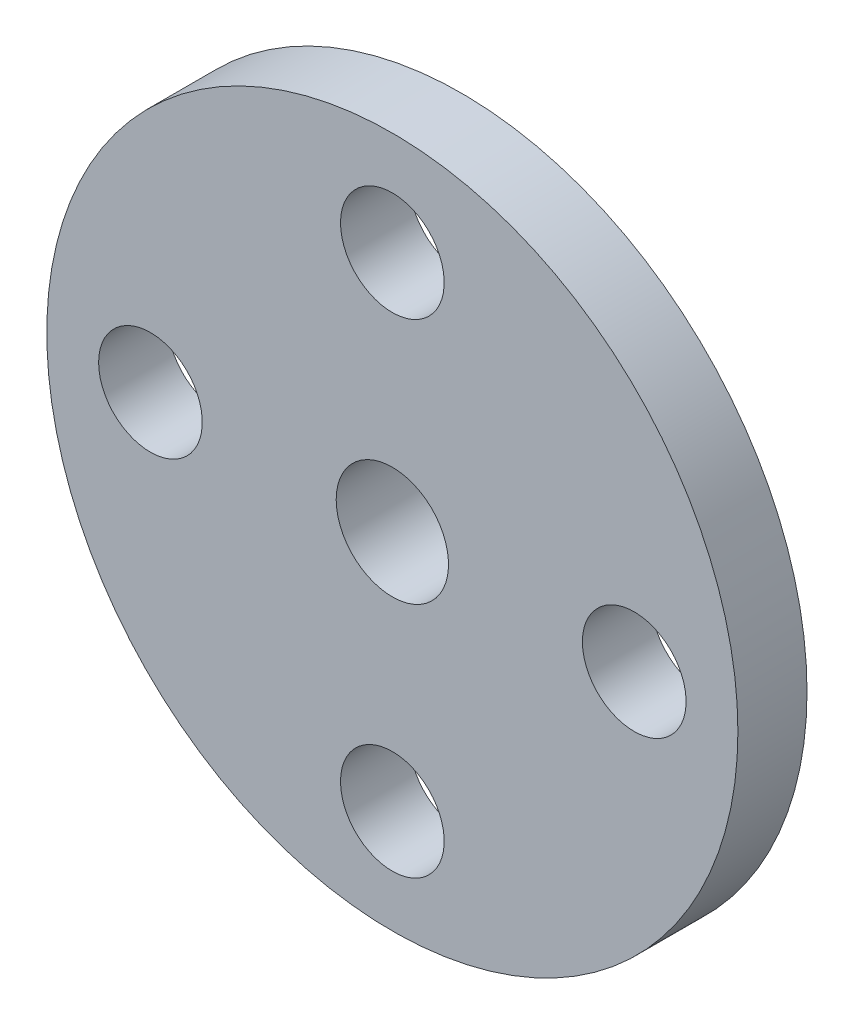
ISO-10303-21;
HEADER;
FILE_DESCRIPTION(('STEP AP214'),'2;1');
FILE_NAME('part.step','',(''),(''),'','','');
FILE_SCHEMA(('AUTOMOTIVE_DESIGN { 1 0 10303 214 1 1 1 1 }'));
ENDSEC;
DATA;
#1=APPLICATION_CONTEXT('core data for automotive mechanical design processes');
#2=APPLICATION_PROTOCOL_DEFINITION('international standard','automotive_design',2000,#1);
#3=PRODUCT_CONTEXT('',#1,'mechanical');
#4=PRODUCT('Part','Part','',(#3));
#5=PRODUCT_RELATED_PRODUCT_CATEGORY('part','',(#4));
#6=PRODUCT_DEFINITION_FORMATION('','',#4);
#7=PRODUCT_DEFINITION_CONTEXT('part definition',#1,'design');
#8=PRODUCT_DEFINITION('design','',#6,#7);
#9=PRODUCT_DEFINITION_SHAPE('','',#8);
#10=(LENGTH_UNIT() NAMED_UNIT(*) SI_UNIT(.MILLI.,.METRE.));
#11=(NAMED_UNIT(*) PLANE_ANGLE_UNIT() SI_UNIT($,.RADIAN.));
#12=(NAMED_UNIT(*) SI_UNIT($,.STERADIAN.) SOLID_ANGLE_UNIT());
#13=UNCERTAINTY_MEASURE_WITH_UNIT(LENGTH_MEASURE(1.E-05),#10,'distance_accuracy_value','');
#14=(GEOMETRIC_REPRESENTATION_CONTEXT(3) GLOBAL_UNCERTAINTY_ASSIGNED_CONTEXT((#13)) GLOBAL_UNIT_ASSIGNED_CONTEXT((#10,
#11,#12)) REPRESENTATION_CONTEXT('',''));
#15=CARTESIAN_POINT('',(0.,0.,0.));
#16=DIRECTION('',(0.,0.,1.));
#17=DIRECTION('',(1.,0.,0.));
#18=AXIS2_PLACEMENT_3D('',#15,#16,#17);
#19=CARTESIAN_POINT('',(0.,0.,2.));
#20=DIRECTION('',(0.,0.,-1.));
#21=DIRECTION('',(-1.,0.,0.));
#22=AXIS2_PLACEMENT_3D('',#19,#20,#21);
#23=CYLINDRICAL_SURFACE('',#22,10.);
#24=CARTESIAN_POINT('',(0.,0.,2.));
#25=DIRECTION('',(0.,0.,1.));
#26=DIRECTION('',(1.,0.,0.));
#27=AXIS2_PLACEMENT_3D('',#24,#25,#26);
#28=CIRCLE('',#27,10.);
#29=CARTESIAN_POINT('',(10.,0.,2.));
#30=VERTEX_POINT('',#29);
#31=EDGE_CURVE('E10',#30,#30,#28,.T.);
#32=ORIENTED_EDGE('',*,*,#31,.F.);
#33=EDGE_LOOP('',(#32));
#34=FACE_BOUND('',#33,.T.);
#35=CARTESIAN_POINT('',(0.,0.,0.));
#36=DIRECTION('',(0.,0.,1.));
#37=DIRECTION('',(1.,0.,0.));
#38=AXIS2_PLACEMENT_3D('',#35,#36,#37);
#39=CIRCLE('',#38,10.);
#40=CARTESIAN_POINT('',(10.,0.,0.));
#41=VERTEX_POINT('',#40);
#42=EDGE_CURVE('E51',#41,#41,#39,.T.);
#43=ORIENTED_EDGE('',*,*,#42,.T.);
#44=EDGE_LOOP('',(#43));
#45=FACE_BOUND('',#44,.T.);
#46=ADVANCED_FACE('F48',(#34,#45),#23,.T.);
#47=CARTESIAN_POINT('',(0.,0.,2.));
#48=DIRECTION('',(0.,0.,1.));
#49=DIRECTION('',(1.,0.,0.));
#50=AXIS2_PLACEMENT_3D('',#47,#48,#49);
#51=PLANE('',#50);
#52=CARTESIAN_POINT('',(0.,0.,2.));
#53=DIRECTION('',(0.,0.,-1.));
#54=DIRECTION('',(-1.,0.,0.));
#55=AXIS2_PLACEMENT_3D('',#52,#53,#54);
#56=CIRCLE('',#55,1.625);
#57=CARTESIAN_POINT('',(-1.625,0.,2.));
#58=VERTEX_POINT('',#57);
#59=EDGE_CURVE('E98',#58,#58,#56,.T.);
#60=ORIENTED_EDGE('',*,*,#59,.T.);
#61=EDGE_LOOP('',(#60));
#62=FACE_BOUND('',#61,.T.);
#63=CARTESIAN_POINT('',(7.,0.,2.));
#64=DIRECTION('',(0.,0.,-1.));
#65=DIRECTION('',(-1.,0.,0.));
#66=AXIS2_PLACEMENT_3D('',#63,#64,#65);
#67=CIRCLE('',#66,1.5);
#68=CARTESIAN_POINT('',(5.5,0.,2.));
#69=VERTEX_POINT('',#68);
#70=EDGE_CURVE('E85',#69,#69,#67,.T.);
#71=ORIENTED_EDGE('',*,*,#70,.T.);
#72=EDGE_LOOP('',(#71));
#73=FACE_BOUND('',#72,.T.);
#74=CARTESIAN_POINT('',(-7.,0.,2.));
#75=DIRECTION('',(0.,0.,-1.));
#76=DIRECTION('',(-1.,0.,0.));
#77=AXIS2_PLACEMENT_3D('',#74,#75,#76);
#78=CIRCLE('',#77,1.5);
#79=CARTESIAN_POINT('',(-8.5,0.,2.));
#80=VERTEX_POINT('',#79);
#81=EDGE_CURVE('E77',#80,#80,#78,.T.);
#82=ORIENTED_EDGE('',*,*,#81,.T.);
#83=EDGE_LOOP('',(#82));
#84=FACE_BOUND('',#83,.T.);
#85=CARTESIAN_POINT('',(0.,-7.,2.));
#86=DIRECTION('',(0.,0.,-1.));
#87=DIRECTION('',(-1.,0.,0.));
#88=AXIS2_PLACEMENT_3D('',#85,#86,#87);
#89=CIRCLE('',#88,1.5);
#90=CARTESIAN_POINT('',(-1.5,-7.,2.));
#91=VERTEX_POINT('',#90);
#92=EDGE_CURVE('E69',#91,#91,#89,.T.);
#93=ORIENTED_EDGE('',*,*,#92,.T.);
#94=EDGE_LOOP('',(#93));
#95=FACE_BOUND('',#94,.T.);
#96=CARTESIAN_POINT('',(0.,7.,2.));
#97=DIRECTION('',(0.,0.,-1.));
#98=DIRECTION('',(-1.,0.,0.));
#99=AXIS2_PLACEMENT_3D('',#96,#97,#98);
#100=CIRCLE('',#99,1.5);
#101=CARTESIAN_POINT('',(-1.5,7.,2.));
#102=VERTEX_POINT('',#101);
#103=EDGE_CURVE('E60',#102,#102,#100,.T.);
#104=ORIENTED_EDGE('',*,*,#103,.T.);
#105=EDGE_LOOP('',(#104));
#106=FACE_BOUND('',#105,.T.);
#107=ORIENTED_EDGE('',*,*,#31,.T.);
#108=EDGE_LOOP('',(#107));
#109=FACE_BOUND('',#108,.T.);
#110=ADVANCED_FACE('F110',(#62,#73,#84,#95,#106,#109),#51,.T.);
#111=CARTESIAN_POINT('',(0.,0.,0.));
#112=DIRECTION('',(0.,0.,1.));
#113=DIRECTION('',(1.,0.,0.));
#114=AXIS2_PLACEMENT_3D('',#111,#112,#113);
#115=PLANE('',#114);
#116=CARTESIAN_POINT('',(0.,0.,0.));
#117=DIRECTION('',(0.,0.,1.));
#118=DIRECTION('',(1.,0.,0.));
#119=AXIS2_PLACEMENT_3D('',#116,#117,#118);
#120=CIRCLE('',#119,4.5);
#121=CARTESIAN_POINT('',(4.5,0.,0.));
#122=VERTEX_POINT('',#121);
#123=EDGE_CURVE('E94',#122,#122,#120,.T.);
#124=ORIENTED_EDGE('',*,*,#123,.T.);
#125=EDGE_LOOP('',(#124));
#126=FACE_BOUND('',#125,.T.);
#127=CARTESIAN_POINT('',(7.,0.,0.));
#128=DIRECTION('',(0.,0.,-1.));
#129=DIRECTION('',(-1.,0.,0.));
#130=AXIS2_PLACEMENT_3D('',#127,#128,#129);
#131=CIRCLE('',#130,1.5);
#132=CARTESIAN_POINT('',(5.5,0.,0.));
#133=VERTEX_POINT('',#132);
#134=EDGE_CURVE('E89',#133,#133,#131,.T.);
#135=ORIENTED_EDGE('',*,*,#134,.F.);
#136=EDGE_LOOP('',(#135));
#137=FACE_BOUND('',#136,.T.);
#138=CARTESIAN_POINT('',(-7.,0.,0.));
#139=DIRECTION('',(0.,0.,-1.));
#140=DIRECTION('',(-1.,0.,0.));
#141=AXIS2_PLACEMENT_3D('',#138,#139,#140);
#142=CIRCLE('',#141,1.5);
#143=CARTESIAN_POINT('',(-8.5,0.,0.));
#144=VERTEX_POINT('',#143);
#145=EDGE_CURVE('E81',#144,#144,#142,.T.);
#146=ORIENTED_EDGE('',*,*,#145,.F.);
#147=EDGE_LOOP('',(#146));
#148=FACE_BOUND('',#147,.T.);
#149=CARTESIAN_POINT('',(0.,-7.,0.));
#150=DIRECTION('',(0.,0.,-1.));
#151=DIRECTION('',(-1.,0.,0.));
#152=AXIS2_PLACEMENT_3D('',#149,#150,#151);
#153=CIRCLE('',#152,1.5);
#154=CARTESIAN_POINT('',(-1.5,-7.,0.));
#155=VERTEX_POINT('',#154);
#156=EDGE_CURVE('E73',#155,#155,#153,.T.);
#157=ORIENTED_EDGE('',*,*,#156,.F.);
#158=EDGE_LOOP('',(#157));
#159=FACE_BOUND('',#158,.T.);
#160=CARTESIAN_POINT('',(0.,7.,0.));
#161=DIRECTION('',(0.,0.,-1.));
#162=DIRECTION('',(-1.,0.,0.));
#163=AXIS2_PLACEMENT_3D('',#160,#161,#162);
#164=CIRCLE('',#163,1.5);
#165=CARTESIAN_POINT('',(-1.5,7.,0.));
#166=VERTEX_POINT('',#165);
#167=EDGE_CURVE('E65',#166,#166,#164,.T.);
#168=ORIENTED_EDGE('',*,*,#167,.F.);
#169=EDGE_LOOP('',(#168));
#170=FACE_BOUND('',#169,.T.);
#171=ORIENTED_EDGE('',*,*,#42,.F.);
#172=EDGE_LOOP('',(#171));
#173=FACE_BOUND('',#172,.T.);
#174=ADVANCED_FACE('F132',(#126,#137,#148,#159,#170,#173),#115,.F.);
#175=CARTESIAN_POINT('',(0.,7.,0.));
#176=DIRECTION('',(0.,0.,-1.));
#177=DIRECTION('',(-1.,0.,0.));
#178=AXIS2_PLACEMENT_3D('',#175,#176,#177);
#179=CYLINDRICAL_SURFACE('',#178,1.5);
#180=ORIENTED_EDGE('',*,*,#103,.F.);
#181=EDGE_LOOP('',(#180));
#182=FACE_BOUND('',#181,.T.);
#183=ORIENTED_EDGE('',*,*,#167,.T.);
#184=EDGE_LOOP('',(#183));
#185=FACE_BOUND('',#184,.T.);
#186=ADVANCED_FACE('F135',(#182,#185),#179,.F.);
#187=CARTESIAN_POINT('',(0.,-7.,0.));
#188=DIRECTION('',(0.,0.,-1.));
#189=DIRECTION('',(-1.,0.,0.));
#190=AXIS2_PLACEMENT_3D('',#187,#188,#189);
#191=CYLINDRICAL_SURFACE('',#190,1.5);
#192=ORIENTED_EDGE('',*,*,#92,.F.);
#193=EDGE_LOOP('',(#192));
#194=FACE_BOUND('',#193,.T.);
#195=ORIENTED_EDGE('',*,*,#156,.T.);
#196=EDGE_LOOP('',(#195));
#197=FACE_BOUND('',#196,.T.);
#198=ADVANCED_FACE('F157',(#194,#197),#191,.F.);
#199=CARTESIAN_POINT('',(-7.,0.,0.));
#200=DIRECTION('',(0.,0.,-1.));
#201=DIRECTION('',(-1.,0.,0.));
#202=AXIS2_PLACEMENT_3D('',#199,#200,#201);
#203=CYLINDRICAL_SURFACE('',#202,1.5);
#204=ORIENTED_EDGE('',*,*,#81,.F.);
#205=EDGE_LOOP('',(#204));
#206=FACE_BOUND('',#205,.T.);
#207=ORIENTED_EDGE('',*,*,#145,.T.);
#208=EDGE_LOOP('',(#207));
#209=FACE_BOUND('',#208,.T.);
#210=ADVANCED_FACE('F161',(#206,#209),#203,.F.);
#211=CARTESIAN_POINT('',(7.,0.,0.));
#212=DIRECTION('',(0.,0.,-1.));
#213=DIRECTION('',(-1.,0.,0.));
#214=AXIS2_PLACEMENT_3D('',#211,#212,#213);
#215=CYLINDRICAL_SURFACE('',#214,1.5);
#216=ORIENTED_EDGE('',*,*,#70,.F.);
#217=EDGE_LOOP('',(#216));
#218=FACE_BOUND('',#217,.T.);
#219=ORIENTED_EDGE('',*,*,#134,.T.);
#220=EDGE_LOOP('',(#219));
#221=FACE_BOUND('',#220,.T.);
#222=ADVANCED_FACE('F128',(#218,#221),#215,.F.);
#223=CARTESIAN_POINT('',(0.,0.,-2.));
#224=DIRECTION('',(0.,0.,1.));
#225=DIRECTION('',(1.,0.,0.));
#226=AXIS2_PLACEMENT_3D('',#223,#224,#225);
#227=CYLINDRICAL_SURFACE('',#226,4.5);
#228=CARTESIAN_POINT('',(0.,0.,-2.));
#229=DIRECTION('',(0.,0.,1.));
#230=DIRECTION('',(1.,0.,0.));
#231=AXIS2_PLACEMENT_3D('',#228,#229,#230);
#232=CIRCLE('',#231,4.5);
#233=CARTESIAN_POINT('',(4.5,0.,-2.));
#234=VERTEX_POINT('',#233);
#235=EDGE_CURVE('E93',#234,#234,#232,.T.);
#236=ORIENTED_EDGE('',*,*,#235,.T.);
#237=EDGE_LOOP('',(#236));
#238=FACE_BOUND('',#237,.T.);
#239=ORIENTED_EDGE('',*,*,#123,.F.);
#240=EDGE_LOOP('',(#239));
#241=FACE_BOUND('',#240,.T.);
#242=ADVANCED_FACE('F122',(#238,#241),#227,.T.);
#243=CARTESIAN_POINT('',(0.,0.,-2.));
#244=DIRECTION('',(0.,0.,1.));
#245=DIRECTION('',(1.,0.,0.));
#246=AXIS2_PLACEMENT_3D('',#243,#244,#245);
#247=PLANE('',#246);
#248=CARTESIAN_POINT('',(0.,0.,-2.));
#249=DIRECTION('',(0.,0.,-1.));
#250=DIRECTION('',(-1.,0.,0.));
#251=AXIS2_PLACEMENT_3D('',#248,#249,#250);
#252=CIRCLE('',#251,1.625);
#253=CARTESIAN_POINT('',(-1.625,0.,-2.));
#254=VERTEX_POINT('',#253);
#255=EDGE_CURVE('E102',#254,#254,#252,.T.);
#256=ORIENTED_EDGE('',*,*,#255,.F.);
#257=EDGE_LOOP('',(#256));
#258=FACE_BOUND('',#257,.T.);
#259=ORIENTED_EDGE('',*,*,#235,.F.);
#260=EDGE_LOOP('',(#259));
#261=FACE_BOUND('',#260,.T.);
#262=ADVANCED_FACE('F116',(#258,#261),#247,.F.);
#263=CARTESIAN_POINT('',(0.,0.,2.));
#264=DIRECTION('',(0.,0.,-1.));
#265=DIRECTION('',(-1.,0.,0.));
#266=AXIS2_PLACEMENT_3D('',#263,#264,#265);
#267=CYLINDRICAL_SURFACE('',#266,1.625);
#268=ORIENTED_EDGE('',*,*,#59,.F.);
#269=EDGE_LOOP('',(#268));
#270=FACE_BOUND('',#269,.T.);
#271=ORIENTED_EDGE('',*,*,#255,.T.);
#272=EDGE_LOOP('',(#271));
#273=FACE_BOUND('',#272,.T.);
#274=ADVANCED_FACE('F113',(#270,#273),#267,.F.);
#275=CLOSED_SHELL('',(#46,#110,#174,#186,#198,#210,#222,#242,#262,#274));
#276=MANIFOLD_SOLID_BREP('B2',#275);
#277=ADVANCED_BREP_SHAPE_REPRESENTATION('',(#18,#276),#14);
#278=SHAPE_DEFINITION_REPRESENTATION(#9,#277);
ENDSEC;
END-ISO-10303-21;
